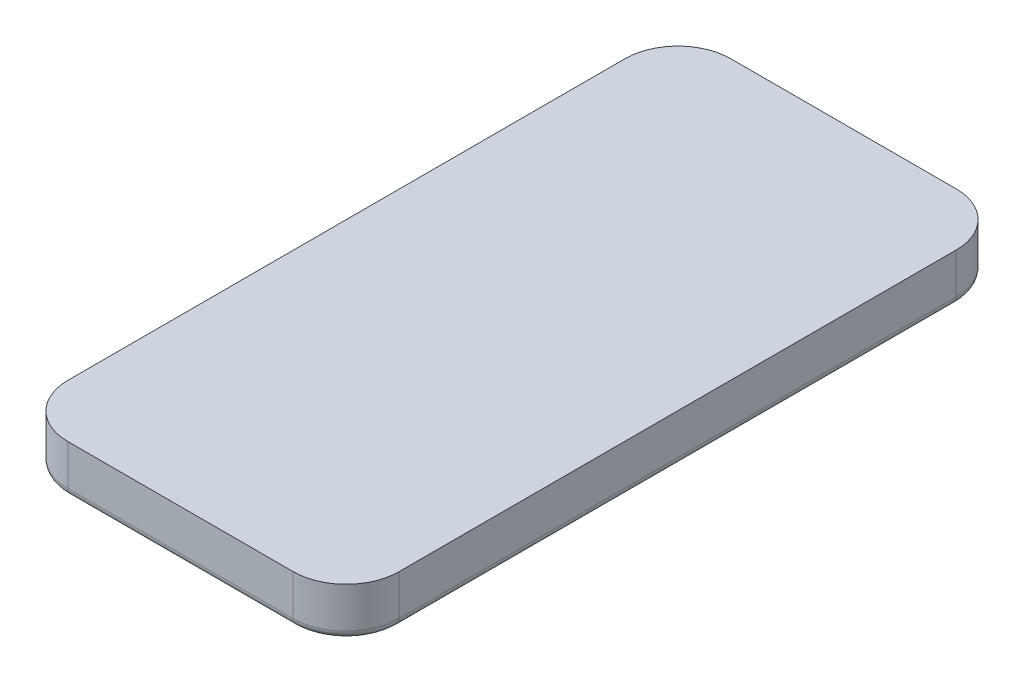
ISO-10303-21;
HEADER;
FILE_DESCRIPTION(('STEP AP214'),'2;1');
FILE_NAME('part.step','',(''),(''),'','','');
FILE_SCHEMA(('AUTOMOTIVE_DESIGN { 1 0 10303 214 1 1 1 1 }'));
ENDSEC;
DATA;
#1=APPLICATION_CONTEXT('core data for automotive mechanical design processes');
#2=APPLICATION_PROTOCOL_DEFINITION('international standard','automotive_design',2000,#1);
#3=PRODUCT_CONTEXT('',#1,'mechanical');
#4=PRODUCT('Part','Part','',(#3));
#5=PRODUCT_RELATED_PRODUCT_CATEGORY('part','',(#4));
#6=PRODUCT_DEFINITION_FORMATION('','',#4);
#7=PRODUCT_DEFINITION_CONTEXT('part definition',#1,'design');
#8=PRODUCT_DEFINITION('design','',#6,#7);
#9=PRODUCT_DEFINITION_SHAPE('','',#8);
#10=(LENGTH_UNIT() NAMED_UNIT(*) SI_UNIT(.MILLI.,.METRE.));
#11=(NAMED_UNIT(*) PLANE_ANGLE_UNIT() SI_UNIT($,.RADIAN.));
#12=(NAMED_UNIT(*) SI_UNIT($,.STERADIAN.) SOLID_ANGLE_UNIT());
#13=UNCERTAINTY_MEASURE_WITH_UNIT(LENGTH_MEASURE(1.E-05),#10,'distance_accuracy_value','');
#14=(GEOMETRIC_REPRESENTATION_CONTEXT(3) GLOBAL_UNCERTAINTY_ASSIGNED_CONTEXT((#13)) GLOBAL_UNIT_ASSIGNED_CONTEXT((#10,
#11,#12)) REPRESENTATION_CONTEXT('',''));
#15=CARTESIAN_POINT('',(0.,0.,0.));
#16=DIRECTION('',(0.,0.,1.));
#17=DIRECTION('',(1.,0.,0.));
#18=AXIS2_PLACEMENT_3D('',#15,#16,#17);
#19=CARTESIAN_POINT('',(0.,0.,0.));
#20=DIRECTION('',(0.,-1.,0.));
#21=DIRECTION('',(0.,0.,-1.));
#22=AXIS2_PLACEMENT_3D('',#19,#20,#21);
#23=PLANE('',#22);
#24=CARTESIAN_POINT('',(-25.55,0.,-63.15));
#25=DIRECTION('',(0.,-1.,0.));
#26=DIRECTION('',(0.,0.,-1.));
#27=AXIS2_PLACEMENT_3D('',#24,#25,#26);
#28=CIRCLE('',#27,10.2);
#29=CARTESIAN_POINT('',(-35.75,0.,-63.15));
#30=VERTEX_POINT('',#29);
#31=CARTESIAN_POINT('',(-25.55,0.,-73.35));
#32=VERTEX_POINT('',#31);
#33=EDGE_CURVE('E260',#30,#32,#28,.T.);
#34=ORIENTED_EDGE('',*,*,#33,.T.);
#35=DIRECTION('',(-1.,0.,0.));
#36=VECTOR('',#35,1.);
#37=CARTESIAN_POINT('',(25.55,0.,-73.35));
#38=LINE('',#37,#36);
#39=CARTESIAN_POINT('',(25.55,0.,-73.35));
#40=VERTEX_POINT('',#39);
#41=EDGE_CURVE('E262',#32,#40,#38,.F.);
#42=ORIENTED_EDGE('',*,*,#41,.T.);
#43=CARTESIAN_POINT('',(25.55,0.,-63.15));
#44=DIRECTION('',(0.,-1.,0.));
#45=DIRECTION('',(0.,0.,-1.));
#46=AXIS2_PLACEMENT_3D('',#43,#44,#45);
#47=CIRCLE('',#46,10.2);
#48=CARTESIAN_POINT('',(35.75,0.,-63.15));
#49=VERTEX_POINT('',#48);
#50=EDGE_CURVE('E248',#40,#49,#47,.T.);
#51=ORIENTED_EDGE('',*,*,#50,.T.);
#52=DIRECTION('',(0.,0.,-1.));
#53=VECTOR('',#52,1.);
#54=CARTESIAN_POINT('',(35.75,0.,63.15));
#55=LINE('',#54,#53);
#56=CARTESIAN_POINT('',(35.75,0.,63.15));
#57=VERTEX_POINT('',#56);
#58=EDGE_CURVE('E250',#49,#57,#55,.F.);
#59=ORIENTED_EDGE('',*,*,#58,.T.);
#60=CARTESIAN_POINT('',(25.55,0.,63.15));
#61=DIRECTION('',(0.,-1.,0.));
#62=DIRECTION('',(0.,0.,-1.));
#63=AXIS2_PLACEMENT_3D('',#60,#61,#62);
#64=CIRCLE('',#63,10.2);
#65=CARTESIAN_POINT('',(25.55,0.,73.35));
#66=VERTEX_POINT('',#65);
#67=EDGE_CURVE('E252',#57,#66,#64,.T.);
#68=ORIENTED_EDGE('',*,*,#67,.T.);
#69=DIRECTION('',(1.,0.,0.));
#70=VECTOR('',#69,1.);
#71=CARTESIAN_POINT('',(-25.55,0.,73.35));
#72=LINE('',#71,#70);
#73=CARTESIAN_POINT('',(-25.55,0.,73.35));
#74=VERTEX_POINT('',#73);
#75=EDGE_CURVE('E254',#66,#74,#72,.F.);
#76=ORIENTED_EDGE('',*,*,#75,.T.);
#77=CARTESIAN_POINT('',(-25.55,0.,63.15));
#78=DIRECTION('',(0.,-1.,0.));
#79=DIRECTION('',(0.,0.,-1.));
#80=AXIS2_PLACEMENT_3D('',#77,#78,#79);
#81=CIRCLE('',#80,10.2);
#82=CARTESIAN_POINT('',(-35.75,0.,63.15));
#83=VERTEX_POINT('',#82);
#84=EDGE_CURVE('E256',#74,#83,#81,.T.);
#85=ORIENTED_EDGE('',*,*,#84,.T.);
#86=DIRECTION('',(0.,0.,1.));
#87=VECTOR('',#86,1.);
#88=CARTESIAN_POINT('',(-35.75,0.,-63.15));
#89=LINE('',#88,#87);
#90=EDGE_CURVE('E258',#83,#30,#89,.F.);
#91=ORIENTED_EDGE('',*,*,#90,.T.);
#92=EDGE_LOOP('',(#34,#42,#51,#59,#68,#76,#85,#91));
#93=FACE_BOUND('',#92,.T.);
#94=DIRECTION('',(0.,0.,1.));
#95=VECTOR('',#94,1.);
#96=CARTESIAN_POINT('',(33.45,0.,-58.6499999999999));
#97=LINE('',#96,#95);
#98=CARTESIAN_POINT('',(33.45,0.,-58.6499999999999));
#99=VERTEX_POINT('',#98);
#100=CARTESIAN_POINT('',(33.45,0.,-41.8500000000001));
#101=VERTEX_POINT('',#100);
#102=EDGE_CURVE('E509',#99,#101,#97,.T.);
#103=ORIENTED_EDGE('',*,*,#102,.F.);
#104=CARTESIAN_POINT('',(21.45,0.,-58.65));
#105=DIRECTION('',(0.,-1.,0.));
#106=DIRECTION('',(0.,0.,1.));
#107=AXIS2_PLACEMENT_3D('',#104,#105,#106);
#108=CIRCLE('',#107,12.);
#109=CARTESIAN_POINT('',(21.4499999999999,0.,-70.65));
#110=VERTEX_POINT('',#109);
#111=EDGE_CURVE('E196',#110,#99,#108,.T.);
#112=ORIENTED_EDGE('',*,*,#111,.F.);
#113=DIRECTION('',(1.,0.,0.));
#114=VECTOR('',#113,1.);
#115=CARTESIAN_POINT('',(5.45000000000007,0.,-70.65));
#116=LINE('',#115,#114);
#117=CARTESIAN_POINT('',(5.45,0.,-70.65));
#118=VERTEX_POINT('',#117);
#119=EDGE_CURVE('E192',#118,#110,#116,.T.);
#120=ORIENTED_EDGE('',*,*,#119,.F.);
#121=CARTESIAN_POINT('',(5.45,0.,-58.65));
#122=DIRECTION('',(0.,-1.,0.));
#123=DIRECTION('',(0.,0.,-1.));
#124=AXIS2_PLACEMENT_3D('',#121,#122,#123);
#125=CIRCLE('',#124,12.);
#126=CARTESIAN_POINT('',(-6.55,0.,-58.6499999999999));
#127=VERTEX_POINT('',#126);
#128=EDGE_CURVE('E505',#127,#118,#125,.T.);
#129=ORIENTED_EDGE('',*,*,#128,.F.);
#130=DIRECTION('',(0.,0.,-1.));
#131=VECTOR('',#130,1.);
#132=CARTESIAN_POINT('',(-6.55000000000001,0.,-41.8500000000001));
#133=LINE('',#132,#131);
#134=CARTESIAN_POINT('',(-6.55,0.,-41.8500000000001));
#135=VERTEX_POINT('',#134);
#136=EDGE_CURVE('E521',#135,#127,#133,.T.);
#137=ORIENTED_EDGE('',*,*,#136,.F.);
#138=CARTESIAN_POINT('',(5.44999999999999,0.,-41.85));
#139=DIRECTION('',(0.,-1.,0.));
#140=DIRECTION('',(0.,0.,-1.));
#141=AXIS2_PLACEMENT_3D('',#138,#139,#140);
#142=CIRCLE('',#141,12.);
#143=CARTESIAN_POINT('',(5.45000000000008,0.,-29.85));
#144=VERTEX_POINT('',#143);
#145=EDGE_CURVE('E519',#144,#135,#142,.T.);
#146=ORIENTED_EDGE('',*,*,#145,.F.);
#147=DIRECTION('',(-1.,0.,0.));
#148=VECTOR('',#147,1.);
#149=CARTESIAN_POINT('',(21.4499999999999,0.,-29.85));
#150=LINE('',#149,#148);
#151=CARTESIAN_POINT('',(21.4499999999999,0.,-29.85));
#152=VERTEX_POINT('',#151);
#153=EDGE_CURVE('E517',#152,#144,#150,.T.);
#154=ORIENTED_EDGE('',*,*,#153,.F.);
#155=CARTESIAN_POINT('',(21.45,0.,-41.85));
#156=DIRECTION('',(0.,-1.,0.));
#157=DIRECTION('',(0.,0.,1.));
#158=AXIS2_PLACEMENT_3D('',#155,#156,#157);
#159=CIRCLE('',#158,12.);
#160=EDGE_CURVE('E511',#101,#152,#159,.T.);
#161=ORIENTED_EDGE('',*,*,#160,.F.);
#162=EDGE_LOOP('',(#103,#112,#120,#129,#137,#146,#154,#161));
#163=FACE_BOUND('',#162,.T.);
#164=ADVANCED_FACE('F35',(#93,#163),#23,.T.);
#165=CARTESIAN_POINT('',(37.55,11.,-75.15));
#166=DIRECTION('',(-1.,0.,0.));
#167=DIRECTION('',(0.,0.,1.));
#168=AXIS2_PLACEMENT_3D('',#165,#166,#167);
#169=PLANE('',#168);
#170=DIRECTION('',(0.,-1.,0.));
#171=VECTOR('',#170,1.);
#172=CARTESIAN_POINT('',(37.55,11.,63.15));
#173=LINE('',#172,#171);
#174=CARTESIAN_POINT('',(37.55,11.,63.15));
#175=VERTEX_POINT('',#174);
#176=CARTESIAN_POINT('',(37.55,1.8,63.15));
#177=VERTEX_POINT('',#176);
#178=EDGE_CURVE('E223',#175,#177,#173,.T.);
#179=ORIENTED_EDGE('',*,*,#178,.T.);
#180=DIRECTION('',(0.,0.,-1.));
#181=VECTOR('',#180,1.);
#182=CARTESIAN_POINT('',(37.55,1.8,-63.15));
#183=LINE('',#182,#181);
#184=CARTESIAN_POINT('',(37.55,1.8,-63.15));
#185=VERTEX_POINT('',#184);
#186=EDGE_CURVE('E44',#177,#185,#183,.T.);
#187=ORIENTED_EDGE('',*,*,#186,.T.);
#188=DIRECTION('',(0.,-1.,0.));
#189=VECTOR('',#188,1.);
#190=CARTESIAN_POINT('',(37.55,11.,-63.15));
#191=LINE('',#190,#189);
#192=CARTESIAN_POINT('',(37.55,11.,-63.15));
#193=VERTEX_POINT('',#192);
#194=EDGE_CURVE('E225',#185,#193,#191,.F.);
#195=ORIENTED_EDGE('',*,*,#194,.T.);
#196=DIRECTION('',(0.,0.,-1.));
#197=VECTOR('',#196,1.);
#198=CARTESIAN_POINT('',(37.55,11.,-75.15));
#199=LINE('',#198,#197);
#200=EDGE_CURVE('E206',#175,#193,#199,.T.);
#201=ORIENTED_EDGE('',*,*,#200,.F.);
#202=EDGE_LOOP('',(#179,#187,#195,#201));
#203=FACE_BOUND('',#202,.T.);
#204=ADVANCED_FACE('F358',(#203),#169,.F.);
#205=CARTESIAN_POINT('',(-37.55,11.,-75.15));
#206=DIRECTION('',(0.,0.,1.));
#207=DIRECTION('',(1.,0.,0.));
#208=AXIS2_PLACEMENT_3D('',#205,#206,#207);
#209=PLANE('',#208);
#210=DIRECTION('',(0.,-1.,0.));
#211=VECTOR('',#210,1.);
#212=CARTESIAN_POINT('',(25.55,11.,-75.15));
#213=LINE('',#212,#211);
#214=CARTESIAN_POINT('',(25.55,11.,-75.15));
#215=VERTEX_POINT('',#214);
#216=CARTESIAN_POINT('',(25.55,1.8,-75.15));
#217=VERTEX_POINT('',#216);
#218=EDGE_CURVE('E220',#215,#217,#213,.T.);
#219=ORIENTED_EDGE('',*,*,#218,.T.);
#220=DIRECTION('',(-1.,0.,0.));
#221=VECTOR('',#220,1.);
#222=CARTESIAN_POINT('',(-25.55,1.8,-75.15));
#223=LINE('',#222,#221);
#224=CARTESIAN_POINT('',(-25.55,1.8,-75.15));
#225=VERTEX_POINT('',#224);
#226=EDGE_CURVE('E245',#217,#225,#223,.T.);
#227=ORIENTED_EDGE('',*,*,#226,.T.);
#228=DIRECTION('',(0.,-1.,0.));
#229=VECTOR('',#228,1.);
#230=CARTESIAN_POINT('',(-25.55,11.,-75.15));
#231=LINE('',#230,#229);
#232=CARTESIAN_POINT('',(-25.55,11.,-75.15));
#233=VERTEX_POINT('',#232);
#234=EDGE_CURVE('E218',#225,#233,#231,.F.);
#235=ORIENTED_EDGE('',*,*,#234,.T.);
#236=DIRECTION('',(-1.,0.,0.));
#237=VECTOR('',#236,1.);
#238=CARTESIAN_POINT('',(-37.55,11.,-75.15));
#239=LINE('',#238,#237);
#240=EDGE_CURVE('E209',#215,#233,#239,.T.);
#241=ORIENTED_EDGE('',*,*,#240,.F.);
#242=EDGE_LOOP('',(#219,#227,#235,#241));
#243=FACE_BOUND('',#242,.T.);
#244=ADVANCED_FACE('F323',(#243),#209,.F.);
#245=CARTESIAN_POINT('',(-37.55,11.,75.15));
#246=DIRECTION('',(1.,0.,0.));
#247=DIRECTION('',(0.,0.,-1.));
#248=AXIS2_PLACEMENT_3D('',#245,#246,#247);
#249=PLANE('',#248);
#250=DIRECTION('',(0.,-1.,0.));
#251=VECTOR('',#250,1.);
#252=CARTESIAN_POINT('',(-37.55,11.,-63.15));
#253=LINE('',#252,#251);
#254=CARTESIAN_POINT('',(-37.55,11.,-63.15));
#255=VERTEX_POINT('',#254);
#256=CARTESIAN_POINT('',(-37.55,1.8,-63.15));
#257=VERTEX_POINT('',#256);
#258=EDGE_CURVE('E240',#255,#257,#253,.T.);
#259=ORIENTED_EDGE('',*,*,#258,.T.);
#260=DIRECTION('',(0.,0.,1.));
#261=VECTOR('',#260,1.);
#262=CARTESIAN_POINT('',(-37.55,1.8,63.15));
#263=LINE('',#262,#261);
#264=CARTESIAN_POINT('',(-37.55,1.8,63.15));
#265=VERTEX_POINT('',#264);
#266=EDGE_CURVE('E267',#257,#265,#263,.T.);
#267=ORIENTED_EDGE('',*,*,#266,.T.);
#268=DIRECTION('',(0.,-1.,0.));
#269=VECTOR('',#268,1.);
#270=CARTESIAN_POINT('',(-37.55,11.,63.15));
#271=LINE('',#270,#269);
#272=CARTESIAN_POINT('',(-37.55,11.,63.15));
#273=VERTEX_POINT('',#272);
#274=EDGE_CURVE('E243',#265,#273,#271,.F.);
#275=ORIENTED_EDGE('',*,*,#274,.T.);
#276=DIRECTION('',(0.,0.,1.));
#277=VECTOR('',#276,1.);
#278=CARTESIAN_POINT('',(-37.55,11.,75.15));
#279=LINE('',#278,#277);
#280=EDGE_CURVE('E212',#255,#273,#279,.T.);
#281=ORIENTED_EDGE('',*,*,#280,.F.);
#282=EDGE_LOOP('',(#259,#267,#275,#281));
#283=FACE_BOUND('',#282,.T.);
#284=ADVANCED_FACE('F335',(#283),#249,.F.);
#285=CARTESIAN_POINT('',(37.55,11.,75.15));
#286=DIRECTION('',(0.,0.,-1.));
#287=DIRECTION('',(-1.,0.,0.));
#288=AXIS2_PLACEMENT_3D('',#285,#286,#287);
#289=PLANE('',#288);
#290=DIRECTION('',(0.,-1.,0.));
#291=VECTOR('',#290,1.);
#292=CARTESIAN_POINT('',(-25.55,11.,75.15));
#293=LINE('',#292,#291);
#294=CARTESIAN_POINT('',(-25.55,11.,75.15));
#295=VERTEX_POINT('',#294);
#296=CARTESIAN_POINT('',(-25.55,1.8,75.15));
#297=VERTEX_POINT('',#296);
#298=EDGE_CURVE('E235',#295,#297,#293,.T.);
#299=ORIENTED_EDGE('',*,*,#298,.T.);
#300=DIRECTION('',(1.,0.,0.));
#301=VECTOR('',#300,1.);
#302=CARTESIAN_POINT('',(25.55,1.8,75.15));
#303=LINE('',#302,#301);
#304=CARTESIAN_POINT('',(25.55,1.8,75.15));
#305=VERTEX_POINT('',#304);
#306=EDGE_CURVE('E271',#297,#305,#303,.T.);
#307=ORIENTED_EDGE('',*,*,#306,.T.);
#308=DIRECTION('',(0.,-1.,0.));
#309=VECTOR('',#308,1.);
#310=CARTESIAN_POINT('',(25.55,11.,75.15));
#311=LINE('',#310,#309);
#312=CARTESIAN_POINT('',(25.55,11.,75.15));
#313=VERTEX_POINT('',#312);
#314=EDGE_CURVE('E238',#305,#313,#311,.F.);
#315=ORIENTED_EDGE('',*,*,#314,.T.);
#316=DIRECTION('',(1.,0.,0.));
#317=VECTOR('',#316,1.);
#318=CARTESIAN_POINT('',(37.55,11.,75.15));
#319=LINE('',#318,#317);
#320=EDGE_CURVE('E215',#295,#313,#319,.T.);
#321=ORIENTED_EDGE('',*,*,#320,.F.);
#322=EDGE_LOOP('',(#299,#307,#315,#321));
#323=FACE_BOUND('',#322,.T.);
#324=ADVANCED_FACE('F366',(#323),#289,.F.);
#325=CARTESIAN_POINT('',(0.,11.,0.));
#326=DIRECTION('',(0.,-1.,0.));
#327=DIRECTION('',(0.,0.,-1.));
#328=AXIS2_PLACEMENT_3D('',#325,#326,#327);
#329=PLANE('',#328);
#330=ORIENTED_EDGE('',*,*,#200,.T.);
#331=CARTESIAN_POINT('',(25.55,11.,-63.15));
#332=DIRECTION('',(0.,-1.,0.));
#333=DIRECTION('',(0.,0.,-1.));
#334=AXIS2_PLACEMENT_3D('',#331,#332,#333);
#335=CIRCLE('',#334,12.);
#336=EDGE_CURVE('E233',#193,#215,#335,.F.);
#337=ORIENTED_EDGE('',*,*,#336,.T.);
#338=ORIENTED_EDGE('',*,*,#240,.T.);
#339=CARTESIAN_POINT('',(-25.55,11.,-63.15));
#340=DIRECTION('',(0.,-1.,0.));
#341=DIRECTION('',(0.,0.,-1.));
#342=AXIS2_PLACEMENT_3D('',#339,#340,#341);
#343=CIRCLE('',#342,12.);
#344=EDGE_CURVE('E227',#233,#255,#343,.F.);
#345=ORIENTED_EDGE('',*,*,#344,.T.);
#346=ORIENTED_EDGE('',*,*,#280,.T.);
#347=CARTESIAN_POINT('',(-25.55,11.,63.15));
#348=DIRECTION('',(0.,-1.,0.));
#349=DIRECTION('',(0.,0.,-1.));
#350=AXIS2_PLACEMENT_3D('',#347,#348,#349);
#351=CIRCLE('',#350,12.);
#352=EDGE_CURVE('E229',#273,#295,#351,.F.);
#353=ORIENTED_EDGE('',*,*,#352,.T.);
#354=ORIENTED_EDGE('',*,*,#320,.T.);
#355=CARTESIAN_POINT('',(25.55,11.,63.15));
#356=DIRECTION('',(0.,-1.,0.));
#357=DIRECTION('',(0.,0.,-1.));
#358=AXIS2_PLACEMENT_3D('',#355,#356,#357);
#359=CIRCLE('',#358,12.);
#360=EDGE_CURVE('E231',#313,#175,#359,.F.);
#361=ORIENTED_EDGE('',*,*,#360,.T.);
#362=EDGE_LOOP('',(#330,#337,#338,#345,#346,#353,#354,#361));
#363=FACE_BOUND('',#362,.T.);
#364=ADVANCED_FACE('F327',(#363),#329,.F.);
#365=CARTESIAN_POINT('',(25.55,11.,-63.15));
#366=DIRECTION('',(0.,-1.,0.));
#367=DIRECTION('',(0.,0.,-1.));
#368=AXIS2_PLACEMENT_3D('',#365,#366,#367);
#369=CYLINDRICAL_SURFACE('',#368,12.);
#370=ORIENTED_EDGE('',*,*,#194,.F.);
#371=CARTESIAN_POINT('',(25.55,1.8,-63.15));
#372=DIRECTION('',(0.,-1.,0.));
#373=DIRECTION('',(0.,0.,-1.));
#374=AXIS2_PLACEMENT_3D('',#371,#372,#373);
#375=CIRCLE('',#374,12.);
#376=EDGE_CURVE('E11',#185,#217,#375,.F.);
#377=ORIENTED_EDGE('',*,*,#376,.T.);
#378=ORIENTED_EDGE('',*,*,#218,.F.);
#379=ORIENTED_EDGE('',*,*,#336,.F.);
#380=EDGE_LOOP('',(#370,#377,#378,#379));
#381=FACE_BOUND('',#380,.T.);
#382=ADVANCED_FACE('F319',(#381),#369,.T.);
#383=CARTESIAN_POINT('',(25.55,11.,63.15));
#384=DIRECTION('',(0.,-1.,0.));
#385=DIRECTION('',(0.,0.,-1.));
#386=AXIS2_PLACEMENT_3D('',#383,#384,#385);
#387=CYLINDRICAL_SURFACE('',#386,12.);
#388=ORIENTED_EDGE('',*,*,#314,.F.);
#389=CARTESIAN_POINT('',(25.55,1.8,63.15));
#390=DIRECTION('',(0.,-1.,0.));
#391=DIRECTION('',(0.,0.,-1.));
#392=AXIS2_PLACEMENT_3D('',#389,#390,#391);
#393=CIRCLE('',#392,12.);
#394=EDGE_CURVE('E273',#305,#177,#393,.F.);
#395=ORIENTED_EDGE('',*,*,#394,.T.);
#396=ORIENTED_EDGE('',*,*,#178,.F.);
#397=ORIENTED_EDGE('',*,*,#360,.F.);
#398=EDGE_LOOP('',(#388,#395,#396,#397));
#399=FACE_BOUND('',#398,.T.);
#400=ADVANCED_FACE('F376',(#399),#387,.T.);
#401=CARTESIAN_POINT('',(-25.55,11.,63.15));
#402=DIRECTION('',(0.,-1.,0.));
#403=DIRECTION('',(0.,0.,-1.));
#404=AXIS2_PLACEMENT_3D('',#401,#402,#403);
#405=CYLINDRICAL_SURFACE('',#404,12.);
#406=ORIENTED_EDGE('',*,*,#274,.F.);
#407=CARTESIAN_POINT('',(-25.55,1.8,63.15));
#408=DIRECTION('',(0.,-1.,0.));
#409=DIRECTION('',(0.,0.,-1.));
#410=AXIS2_PLACEMENT_3D('',#407,#408,#409);
#411=CIRCLE('',#410,12.);
#412=EDGE_CURVE('E269',#265,#297,#411,.F.);
#413=ORIENTED_EDGE('',*,*,#412,.T.);
#414=ORIENTED_EDGE('',*,*,#298,.F.);
#415=ORIENTED_EDGE('',*,*,#352,.F.);
#416=EDGE_LOOP('',(#406,#413,#414,#415));
#417=FACE_BOUND('',#416,.T.);
#418=ADVANCED_FACE('F379',(#417),#405,.T.);
#419=CARTESIAN_POINT('',(-25.55,11.,-63.15));
#420=DIRECTION('',(0.,-1.,0.));
#421=DIRECTION('',(0.,0.,-1.));
#422=AXIS2_PLACEMENT_3D('',#419,#420,#421);
#423=CYLINDRICAL_SURFACE('',#422,12.);
#424=ORIENTED_EDGE('',*,*,#234,.F.);
#425=CARTESIAN_POINT('',(-25.55,1.8,-63.15));
#426=DIRECTION('',(0.,-1.,0.));
#427=DIRECTION('',(0.,0.,-1.));
#428=AXIS2_PLACEMENT_3D('',#425,#426,#427);
#429=CIRCLE('',#428,12.);
#430=EDGE_CURVE('E265',#225,#257,#429,.F.);
#431=ORIENTED_EDGE('',*,*,#430,.T.);
#432=ORIENTED_EDGE('',*,*,#258,.F.);
#433=ORIENTED_EDGE('',*,*,#344,.F.);
#434=EDGE_LOOP('',(#424,#431,#432,#433));
#435=FACE_BOUND('',#434,.T.);
#436=ADVANCED_FACE('F331',(#435),#423,.T.);
#437=CARTESIAN_POINT('',(37.55,1.8,73.35));
#438=DIRECTION('',(-1.,0.,0.));
#439=DIRECTION('',(0.,0.,1.));
#440=AXIS2_PLACEMENT_3D('',#437,#438,#439);
#441=CYLINDRICAL_SURFACE('',#440,1.8);
#442=CARTESIAN_POINT('',(-25.55,1.8,73.35));
#443=DIRECTION('',(-1.,0.,0.));
#444=DIRECTION('',(0.,0.,1.));
#445=AXIS2_PLACEMENT_3D('',#442,#443,#444);
#446=CIRCLE('',#445,1.8);
#447=EDGE_CURVE('E288',#74,#297,#446,.T.);
#448=ORIENTED_EDGE('',*,*,#447,.F.);
#449=ORIENTED_EDGE('',*,*,#75,.F.);
#450=CARTESIAN_POINT('',(25.55,1.8,73.35));
#451=DIRECTION('',(1.,0.,0.));
#452=DIRECTION('',(0.,0.,-1.));
#453=AXIS2_PLACEMENT_3D('',#450,#451,#452);
#454=CIRCLE('',#453,1.8);
#455=EDGE_CURVE('E39',#305,#66,#454,.T.);
#456=ORIENTED_EDGE('',*,*,#455,.F.);
#457=ORIENTED_EDGE('',*,*,#306,.F.);
#458=EDGE_LOOP('',(#448,#449,#456,#457));
#459=FACE_BOUND('',#458,.T.);
#460=ADVANCED_FACE('F37',(#459),#441,.T.);
#461=CARTESIAN_POINT('',(25.55,1.8,63.15));
#462=DIRECTION('',(0.,-1.,0.));
#463=DIRECTION('',(0.,0.,-1.));
#464=AXIS2_PLACEMENT_3D('',#461,#462,#463);
#465=TOROIDAL_SURFACE('',#464,10.2,1.8);
#466=ORIENTED_EDGE('',*,*,#455,.T.);
#467=ORIENTED_EDGE('',*,*,#67,.F.);
#468=CARTESIAN_POINT('',(35.75,1.8,63.15));
#469=DIRECTION('',(0.,0.,-1.));
#470=DIRECTION('',(-1.,0.,0.));
#471=AXIS2_PLACEMENT_3D('',#468,#469,#470);
#472=CIRCLE('',#471,1.8);
#473=EDGE_CURVE('E286',#177,#57,#472,.T.);
#474=ORIENTED_EDGE('',*,*,#473,.F.);
#475=ORIENTED_EDGE('',*,*,#394,.F.);
#476=EDGE_LOOP('',(#466,#467,#474,#475));
#477=FACE_BOUND('',#476,.T.);
#478=ADVANCED_FACE('F299',(#477),#465,.T.);
#479=CARTESIAN_POINT('',(-25.55,1.8,63.15));
#480=DIRECTION('',(0.,-1.,0.));
#481=DIRECTION('',(0.,0.,-1.));
#482=AXIS2_PLACEMENT_3D('',#479,#480,#481);
#483=TOROIDAL_SURFACE('',#482,10.2,1.8);
#484=ORIENTED_EDGE('',*,*,#447,.T.);
#485=ORIENTED_EDGE('',*,*,#412,.F.);
#486=CARTESIAN_POINT('',(-35.75,1.8,63.15));
#487=DIRECTION('',(0.,0.,-1.));
#488=DIRECTION('',(-1.,0.,0.));
#489=AXIS2_PLACEMENT_3D('',#486,#487,#488);
#490=CIRCLE('',#489,1.8);
#491=EDGE_CURVE('E283',#83,#265,#490,.T.);
#492=ORIENTED_EDGE('',*,*,#491,.F.);
#493=ORIENTED_EDGE('',*,*,#84,.F.);
#494=EDGE_LOOP('',(#484,#485,#492,#493));
#495=FACE_BOUND('',#494,.T.);
#496=ADVANCED_FACE('F390',(#495),#483,.T.);
#497=CARTESIAN_POINT('',(35.75,1.8,-75.15));
#498=DIRECTION('',(0.,0.,1.));
#499=DIRECTION('',(1.,0.,0.));
#500=AXIS2_PLACEMENT_3D('',#497,#498,#499);
#501=CYLINDRICAL_SURFACE('',#500,1.8);
#502=ORIENTED_EDGE('',*,*,#473,.T.);
#503=ORIENTED_EDGE('',*,*,#58,.F.);
#504=CARTESIAN_POINT('',(35.75,1.8,-63.15));
#505=DIRECTION('',(0.,0.,-1.));
#506=DIRECTION('',(-1.,0.,0.));
#507=AXIS2_PLACEMENT_3D('',#504,#505,#506);
#508=CIRCLE('',#507,1.8);
#509=EDGE_CURVE('E280',#185,#49,#508,.T.);
#510=ORIENTED_EDGE('',*,*,#509,.F.);
#511=ORIENTED_EDGE('',*,*,#186,.F.);
#512=EDGE_LOOP('',(#502,#503,#510,#511));
#513=FACE_BOUND('',#512,.T.);
#514=ADVANCED_FACE('F311',(#513),#501,.T.);
#515=CARTESIAN_POINT('',(-35.75,1.8,75.15));
#516=DIRECTION('',(0.,0.,-1.));
#517=DIRECTION('',(-1.,0.,0.));
#518=AXIS2_PLACEMENT_3D('',#515,#516,#517);
#519=CYLINDRICAL_SURFACE('',#518,1.8);
#520=ORIENTED_EDGE('',*,*,#491,.T.);
#521=ORIENTED_EDGE('',*,*,#266,.F.);
#522=CARTESIAN_POINT('',(-35.75,1.8,-63.15));
#523=DIRECTION('',(0.,0.,-1.));
#524=DIRECTION('',(-1.,0.,0.));
#525=AXIS2_PLACEMENT_3D('',#522,#523,#524);
#526=CIRCLE('',#525,1.8);
#527=EDGE_CURVE('E277',#30,#257,#526,.T.);
#528=ORIENTED_EDGE('',*,*,#527,.F.);
#529=ORIENTED_EDGE('',*,*,#90,.F.);
#530=EDGE_LOOP('',(#520,#521,#528,#529));
#531=FACE_BOUND('',#530,.T.);
#532=ADVANCED_FACE('F339',(#531),#519,.T.);
#533=CARTESIAN_POINT('',(25.55,1.8,-63.15));
#534=DIRECTION('',(0.,-1.,0.));
#535=DIRECTION('',(0.,0.,-1.));
#536=AXIS2_PLACEMENT_3D('',#533,#534,#535);
#537=TOROIDAL_SURFACE('',#536,10.2,1.8);
#538=ORIENTED_EDGE('',*,*,#509,.T.);
#539=ORIENTED_EDGE('',*,*,#50,.F.);
#540=CARTESIAN_POINT('',(25.55,1.8,-73.35));
#541=DIRECTION('',(-1.,0.,0.));
#542=DIRECTION('',(0.,0.,1.));
#543=AXIS2_PLACEMENT_3D('',#540,#541,#542);
#544=CIRCLE('',#543,1.8);
#545=EDGE_CURVE('E200',#217,#40,#544,.T.);
#546=ORIENTED_EDGE('',*,*,#545,.F.);
#547=ORIENTED_EDGE('',*,*,#376,.F.);
#548=EDGE_LOOP('',(#538,#539,#546,#547));
#549=FACE_BOUND('',#548,.T.);
#550=ADVANCED_FACE('F314',(#549),#537,.T.);
#551=CARTESIAN_POINT('',(-25.55,1.8,-63.15));
#552=DIRECTION('',(0.,-1.,0.));
#553=DIRECTION('',(0.,0.,-1.));
#554=AXIS2_PLACEMENT_3D('',#551,#552,#553);
#555=TOROIDAL_SURFACE('',#554,10.2,1.8);
#556=ORIENTED_EDGE('',*,*,#527,.T.);
#557=ORIENTED_EDGE('',*,*,#430,.F.);
#558=CARTESIAN_POINT('',(-25.55,1.8,-73.35));
#559=DIRECTION('',(1.,0.,0.));
#560=DIRECTION('',(0.,0.,-1.));
#561=AXIS2_PLACEMENT_3D('',#558,#559,#560);
#562=CIRCLE('',#561,1.8);
#563=EDGE_CURVE('E198',#32,#225,#562,.T.);
#564=ORIENTED_EDGE('',*,*,#563,.F.);
#565=ORIENTED_EDGE('',*,*,#33,.F.);
#566=EDGE_LOOP('',(#556,#557,#564,#565));
#567=FACE_BOUND('',#566,.T.);
#568=ADVANCED_FACE('F343',(#567),#555,.T.);
#569=CARTESIAN_POINT('',(-37.55,1.8,-73.35));
#570=DIRECTION('',(1.,0.,0.));
#571=DIRECTION('',(0.,0.,-1.));
#572=AXIS2_PLACEMENT_3D('',#569,#570,#571);
#573=CYLINDRICAL_SURFACE('',#572,1.8);
#574=ORIENTED_EDGE('',*,*,#545,.T.);
#575=ORIENTED_EDGE('',*,*,#41,.F.);
#576=ORIENTED_EDGE('',*,*,#563,.T.);
#577=ORIENTED_EDGE('',*,*,#226,.F.);
#578=EDGE_LOOP('',(#574,#575,#576,#577));
#579=FACE_BOUND('',#578,.T.);
#580=ADVANCED_FACE('F347',(#579),#573,.T.);
#581=CARTESIAN_POINT('',(21.45,-2.5,-58.65));
#582=DIRECTION('',(0.,1.,0.));
#583=DIRECTION('',(0.,0.,1.));
#584=AXIS2_PLACEMENT_3D('',#581,#582,#583);
#585=CYLINDRICAL_SURFACE('',#584,12.);
#586=ORIENTED_EDGE('',*,*,#111,.T.);
#587=DIRECTION('',(0.,1.,0.));
#588=VECTOR('',#587,1.);
#589=CARTESIAN_POINT('',(33.45,-2.5,-58.6499999999999));
#590=LINE('',#589,#588);
#591=CARTESIAN_POINT('',(33.45,-2.5,-58.6499999999999));
#592=VERTEX_POINT('',#591);
#593=EDGE_CURVE('E177',#592,#99,#590,.T.);
#594=ORIENTED_EDGE('',*,*,#593,.F.);
#595=CARTESIAN_POINT('',(21.45,-2.5,-58.65));
#596=DIRECTION('',(0.,-1.,0.));
#597=DIRECTION('',(0.,0.,1.));
#598=AXIS2_PLACEMENT_3D('',#595,#596,#597);
#599=CIRCLE('',#598,12.);
#600=CARTESIAN_POINT('',(21.4499999999999,-2.5,-70.65));
#601=VERTEX_POINT('',#600);
#602=EDGE_CURVE('E184',#601,#592,#599,.T.);
#603=ORIENTED_EDGE('',*,*,#602,.F.);
#604=DIRECTION('',(0.,1.,0.));
#605=VECTOR('',#604,1.);
#606=CARTESIAN_POINT('',(21.4499999999999,-2.5,-70.65));
#607=LINE('',#606,#605);
#608=EDGE_CURVE('E503',#601,#110,#607,.T.);
#609=ORIENTED_EDGE('',*,*,#608,.T.);
#610=EDGE_LOOP('',(#586,#594,#603,#609));
#611=FACE_BOUND('',#610,.T.);
#612=ADVANCED_FACE('F194',(#611),#585,.T.);
#613=CARTESIAN_POINT('',(33.45,-2.5,-58.6499999999999));
#614=DIRECTION('',(-1.,0.,0.));
#615=DIRECTION('',(0.,0.,1.));
#616=AXIS2_PLACEMENT_3D('',#613,#614,#615);
#617=PLANE('',#616);
#618=ORIENTED_EDGE('',*,*,#102,.T.);
#619=DIRECTION('',(0.,1.,0.));
#620=VECTOR('',#619,1.);
#621=CARTESIAN_POINT('',(33.45,-2.5,-41.8500000000001));
#622=LINE('',#621,#620);
#623=CARTESIAN_POINT('',(33.45,-2.5,-41.8500000000001));
#624=VERTEX_POINT('',#623);
#625=EDGE_CURVE('E180',#624,#101,#622,.T.);
#626=ORIENTED_EDGE('',*,*,#625,.F.);
#627=DIRECTION('',(0.,0.,1.));
#628=VECTOR('',#627,1.);
#629=CARTESIAN_POINT('',(33.45,-2.5,-58.6499999999999));
#630=LINE('',#629,#628);
#631=EDGE_CURVE('E173',#592,#624,#630,.T.);
#632=ORIENTED_EDGE('',*,*,#631,.F.);
#633=ORIENTED_EDGE('',*,*,#593,.T.);
#634=EDGE_LOOP('',(#618,#626,#632,#633));
#635=FACE_BOUND('',#634,.T.);
#636=ADVANCED_FACE('F175',(#635),#617,.F.);
#637=CARTESIAN_POINT('',(21.45,-2.5,-41.85));
#638=DIRECTION('',(0.,1.,0.));
#639=DIRECTION('',(0.,0.,1.));
#640=AXIS2_PLACEMENT_3D('',#637,#638,#639);
#641=CYLINDRICAL_SURFACE('',#640,12.);
#642=ORIENTED_EDGE('',*,*,#160,.T.);
#643=DIRECTION('',(0.,1.,0.));
#644=VECTOR('',#643,1.);
#645=CARTESIAN_POINT('',(21.4499999999999,-2.5,-29.85));
#646=LINE('',#645,#644);
#647=CARTESIAN_POINT('',(21.4499999999999,-2.5,-29.85));
#648=VERTEX_POINT('',#647);
#649=EDGE_CURVE('E202',#648,#152,#646,.T.);
#650=ORIENTED_EDGE('',*,*,#649,.F.);
#651=CARTESIAN_POINT('',(21.45,-2.5,-41.85));
#652=DIRECTION('',(0.,-1.,0.));
#653=DIRECTION('',(0.,0.,1.));
#654=AXIS2_PLACEMENT_3D('',#651,#652,#653);
#655=CIRCLE('',#654,12.);
#656=EDGE_CURVE('E183',#624,#648,#655,.T.);
#657=ORIENTED_EDGE('',*,*,#656,.F.);
#658=ORIENTED_EDGE('',*,*,#625,.T.);
#659=EDGE_LOOP('',(#642,#650,#657,#658));
#660=FACE_BOUND('',#659,.T.);
#661=ADVANCED_FACE('F432',(#660),#641,.T.);
#662=CARTESIAN_POINT('',(21.4499999999999,-2.5,-29.85));
#663=DIRECTION('',(0.,0.,-1.));
#664=DIRECTION('',(-1.,0.,0.));
#665=AXIS2_PLACEMENT_3D('',#662,#663,#664);
#666=PLANE('',#665);
#667=ORIENTED_EDGE('',*,*,#153,.T.);
#668=DIRECTION('',(0.,1.,0.));
#669=VECTOR('',#668,1.);
#670=CARTESIAN_POINT('',(5.45000000000008,-2.5,-29.85));
#671=LINE('',#670,#669);
#672=CARTESIAN_POINT('',(5.45000000000008,-2.5,-29.85));
#673=VERTEX_POINT('',#672);
#674=EDGE_CURVE('E531',#673,#144,#671,.T.);
#675=ORIENTED_EDGE('',*,*,#674,.F.);
#676=DIRECTION('',(-1.,0.,0.));
#677=VECTOR('',#676,1.);
#678=CARTESIAN_POINT('',(21.4499999999999,-2.5,-29.85));
#679=LINE('',#678,#677);
#680=EDGE_CURVE('E538',#648,#673,#679,.T.);
#681=ORIENTED_EDGE('',*,*,#680,.F.);
#682=ORIENTED_EDGE('',*,*,#649,.T.);
#683=EDGE_LOOP('',(#667,#675,#681,#682));
#684=FACE_BOUND('',#683,.T.);
#685=ADVANCED_FACE('F441',(#684),#666,.F.);
#686=CARTESIAN_POINT('',(5.44999999999999,-2.5,-41.85));
#687=DIRECTION('',(0.,1.,0.));
#688=DIRECTION('',(0.,0.,1.));
#689=AXIS2_PLACEMENT_3D('',#686,#687,#688);
#690=CYLINDRICAL_SURFACE('',#689,12.);
#691=ORIENTED_EDGE('',*,*,#145,.T.);
#692=DIRECTION('',(0.,1.,0.));
#693=VECTOR('',#692,1.);
#694=CARTESIAN_POINT('',(-6.55,-2.5,-41.8500000000001));
#695=LINE('',#694,#693);
#696=CARTESIAN_POINT('',(-6.55,-2.5,-41.8500000000001));
#697=VERTEX_POINT('',#696);
#698=EDGE_CURVE('E528',#697,#135,#695,.T.);
#699=ORIENTED_EDGE('',*,*,#698,.F.);
#700=CARTESIAN_POINT('',(5.44999999999999,-2.5,-41.85));
#701=DIRECTION('',(0.,-1.,0.));
#702=DIRECTION('',(0.,0.,-1.));
#703=AXIS2_PLACEMENT_3D('',#700,#701,#702);
#704=CIRCLE('',#703,12.);
#705=EDGE_CURVE('E548',#673,#697,#704,.T.);
#706=ORIENTED_EDGE('',*,*,#705,.F.);
#707=ORIENTED_EDGE('',*,*,#674,.T.);
#708=EDGE_LOOP('',(#691,#699,#706,#707));
#709=FACE_BOUND('',#708,.T.);
#710=ADVANCED_FACE('F451',(#709),#690,.T.);
#711=CARTESIAN_POINT('',(-6.55000000000001,-2.5,-41.8500000000001));
#712=DIRECTION('',(1.,0.,0.));
#713=DIRECTION('',(0.,0.,-1.));
#714=AXIS2_PLACEMENT_3D('',#711,#712,#713);
#715=PLANE('',#714);
#716=ORIENTED_EDGE('',*,*,#136,.T.);
#717=DIRECTION('',(0.,1.,0.));
#718=VECTOR('',#717,1.);
#719=CARTESIAN_POINT('',(-6.55,-2.5,-58.6499999999999));
#720=LINE('',#719,#718);
#721=CARTESIAN_POINT('',(-6.55,-2.5,-58.6499999999999));
#722=VERTEX_POINT('',#721);
#723=EDGE_CURVE('E525',#722,#127,#720,.T.);
#724=ORIENTED_EDGE('',*,*,#723,.F.);
#725=DIRECTION('',(0.,0.,-1.));
#726=VECTOR('',#725,1.);
#727=CARTESIAN_POINT('',(-6.55000000000001,-2.5,-41.8500000000001));
#728=LINE('',#727,#726);
#729=EDGE_CURVE('E545',#697,#722,#728,.T.);
#730=ORIENTED_EDGE('',*,*,#729,.F.);
#731=ORIENTED_EDGE('',*,*,#698,.T.);
#732=EDGE_LOOP('',(#716,#724,#730,#731));
#733=FACE_BOUND('',#732,.T.);
#734=ADVANCED_FACE('F461',(#733),#715,.F.);
#735=CARTESIAN_POINT('',(5.45,-2.5,-58.65));
#736=DIRECTION('',(0.,1.,0.));
#737=DIRECTION('',(0.,0.,1.));
#738=AXIS2_PLACEMENT_3D('',#735,#736,#737);
#739=CYLINDRICAL_SURFACE('',#738,12.);
#740=ORIENTED_EDGE('',*,*,#128,.T.);
#741=DIRECTION('',(0.,1.,0.));
#742=VECTOR('',#741,1.);
#743=CARTESIAN_POINT('',(5.45,-2.5,-70.65));
#744=LINE('',#743,#742);
#745=CARTESIAN_POINT('',(5.45,-2.5,-70.65));
#746=VERTEX_POINT('',#745);
#747=EDGE_CURVE('E52',#746,#118,#744,.T.);
#748=ORIENTED_EDGE('',*,*,#747,.F.);
#749=CARTESIAN_POINT('',(5.45,-2.5,-58.65));
#750=DIRECTION('',(0.,-1.,0.));
#751=DIRECTION('',(0.,0.,-1.));
#752=AXIS2_PLACEMENT_3D('',#749,#750,#751);
#753=CIRCLE('',#752,12.);
#754=EDGE_CURVE('E547',#722,#746,#753,.T.);
#755=ORIENTED_EDGE('',*,*,#754,.F.);
#756=ORIENTED_EDGE('',*,*,#723,.T.);
#757=EDGE_LOOP('',(#740,#748,#755,#756));
#758=FACE_BOUND('',#757,.T.);
#759=ADVANCED_FACE('F471',(#758),#739,.T.);
#760=CARTESIAN_POINT('',(5.45000000000007,-2.5,-70.65));
#761=DIRECTION('',(0.,0.,1.));
#762=DIRECTION('',(1.,0.,0.));
#763=AXIS2_PLACEMENT_3D('',#760,#761,#762);
#764=PLANE('',#763);
#765=ORIENTED_EDGE('',*,*,#119,.T.);
#766=ORIENTED_EDGE('',*,*,#608,.F.);
#767=DIRECTION('',(1.,0.,0.));
#768=VECTOR('',#767,1.);
#769=CARTESIAN_POINT('',(5.45000000000007,-2.5,-70.65));
#770=LINE('',#769,#768);
#771=EDGE_CURVE('E188',#746,#601,#770,.T.);
#772=ORIENTED_EDGE('',*,*,#771,.F.);
#773=ORIENTED_EDGE('',*,*,#747,.T.);
#774=EDGE_LOOP('',(#765,#766,#772,#773));
#775=FACE_BOUND('',#774,.T.);
#776=ADVANCED_FACE('F481',(#775),#764,.F.);
#777=CARTESIAN_POINT('',(21.45,-2.5,-58.65));
#778=DIRECTION('',(0.,1.,0.));
#779=DIRECTION('',(0.,0.,1.));
#780=AXIS2_PLACEMENT_3D('',#777,#778,#779);
#781=PLANE('',#780);
#782=ORIENTED_EDGE('',*,*,#602,.T.);
#783=ORIENTED_EDGE('',*,*,#631,.T.);
#784=ORIENTED_EDGE('',*,*,#656,.T.);
#785=ORIENTED_EDGE('',*,*,#680,.T.);
#786=ORIENTED_EDGE('',*,*,#705,.T.);
#787=ORIENTED_EDGE('',*,*,#729,.T.);
#788=ORIENTED_EDGE('',*,*,#754,.T.);
#789=ORIENTED_EDGE('',*,*,#771,.T.);
#790=EDGE_LOOP('',(#782,#783,#784,#785,#786,#787,#788,#789));
#791=FACE_BOUND('',#790,.T.);
#792=ADVANCED_FACE('F187',(#791),#781,.F.);
#793=CLOSED_SHELL('',(#164,#204,#244,#284,#324,#364,#382,#400,#418,#436,#460,#478,#496,#514,
#532,#550,#568,#580,#612,#636,#661,#685,#710,#734,#759,#776,#792));
#794=MANIFOLD_SOLID_BREP('B2',#793);
#795=ADVANCED_BREP_SHAPE_REPRESENTATION('',(#18,#794),#14);
#796=SHAPE_DEFINITION_REPRESENTATION(#9,#795);
ENDSEC;
END-ISO-10303-21;
